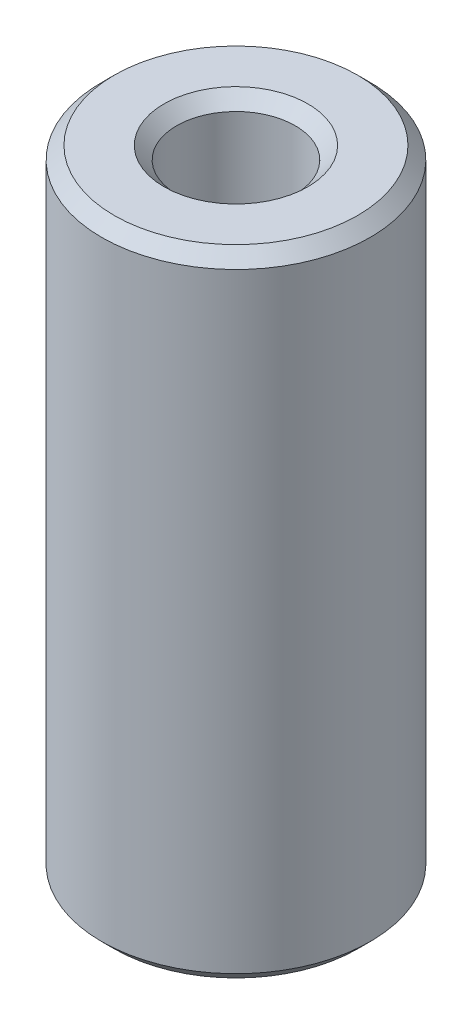
ISO-10303-21;
HEADER;
FILE_DESCRIPTION(('STEP AP214'),'2;1');
FILE_NAME('part.step','',(''),(''),'','','');
FILE_SCHEMA(('AUTOMOTIVE_DESIGN { 1 0 10303 214 1 1 1 1 }'));
ENDSEC;
DATA;
#1=APPLICATION_CONTEXT('core data for automotive mechanical design processes');
#2=APPLICATION_PROTOCOL_DEFINITION('international standard','automotive_design',2000,#1);
#3=PRODUCT_CONTEXT('',#1,'mechanical');
#4=PRODUCT('Part','Part','',(#3));
#5=PRODUCT_RELATED_PRODUCT_CATEGORY('part','',(#4));
#6=PRODUCT_DEFINITION_FORMATION('','',#4);
#7=PRODUCT_DEFINITION_CONTEXT('part definition',#1,'design');
#8=PRODUCT_DEFINITION('design','',#6,#7);
#9=PRODUCT_DEFINITION_SHAPE('','',#8);
#10=(LENGTH_UNIT() NAMED_UNIT(*) SI_UNIT(.MILLI.,.METRE.));
#11=(NAMED_UNIT(*) PLANE_ANGLE_UNIT() SI_UNIT($,.RADIAN.));
#12=(NAMED_UNIT(*) SI_UNIT($,.STERADIAN.) SOLID_ANGLE_UNIT());
#13=UNCERTAINTY_MEASURE_WITH_UNIT(LENGTH_MEASURE(1.E-05),#10,'distance_accuracy_value','');
#14=(GEOMETRIC_REPRESENTATION_CONTEXT(3) GLOBAL_UNCERTAINTY_ASSIGNED_CONTEXT((#13)) GLOBAL_UNIT_ASSIGNED_CONTEXT((#10,
#11,#12)) REPRESENTATION_CONTEXT('',''));
#15=CARTESIAN_POINT('',(0.,0.,0.));
#16=DIRECTION('',(0.,0.,1.));
#17=DIRECTION('',(1.,0.,0.));
#18=AXIS2_PLACEMENT_3D('',#15,#16,#17);
#19=CARTESIAN_POINT('',(0.,141.90652875905,0.));
#20=DIRECTION('',(0.,-1.,0.));
#21=DIRECTION('',(0.,0.,-1.));
#22=AXIS2_PLACEMENT_3D('',#19,#20,#21);
#23=CYLINDRICAL_SURFACE('',#22,30.);
#24=CARTESIAN_POINT('',(0.,2.82088200726871,0.));
#25=DIRECTION('',(0.,1.,0.));
#26=DIRECTION('',(0.,0.,1.));
#27=AXIS2_PLACEMENT_3D('',#24,#25,#26);
#28=CIRCLE('',#27,30.);
#29=CARTESIAN_POINT('',(0.,2.82088200726871,30.));
#30=VERTEX_POINT('',#29);
#31=EDGE_CURVE('E10',#30,#30,#28,.T.);
#32=ORIENTED_EDGE('',*,*,#31,.T.);
#33=EDGE_LOOP('',(#32));
#34=FACE_BOUND('',#33,.T.);
#35=CARTESIAN_POINT('',(0.,139.085646751781,0.));
#36=DIRECTION('',(0.,1.,0.));
#37=DIRECTION('',(0.,0.,1.));
#38=AXIS2_PLACEMENT_3D('',#35,#36,#37);
#39=CIRCLE('',#38,30.);
#40=CARTESIAN_POINT('',(0.,139.085646751781,30.));
#41=VERTEX_POINT('',#40);
#42=EDGE_CURVE('E50',#41,#41,#39,.F.);
#43=ORIENTED_EDGE('',*,*,#42,.T.);
#44=EDGE_LOOP('',(#43));
#45=FACE_BOUND('',#44,.T.);
#46=ADVANCED_FACE('F39',(#34,#45),#23,.T.);
#47=CARTESIAN_POINT('',(0.,141.90652875905,0.));
#48=DIRECTION('',(0.,1.,0.));
#49=DIRECTION('',(0.,0.,1.));
#50=AXIS2_PLACEMENT_3D('',#47,#48,#49);
#51=PLANE('',#50);
#52=CARTESIAN_POINT('',(0.,141.90652875905,0.));
#53=DIRECTION('',(0.,1.,0.));
#54=DIRECTION('',(0.,0.,1.));
#55=AXIS2_PLACEMENT_3D('',#52,#53,#54);
#56=CIRCLE('',#55,16.06842925978);
#57=CARTESIAN_POINT('',(0.,141.90652875905,16.06842925978));
#58=VERTEX_POINT('',#57);
#59=EDGE_CURVE('E58',#58,#58,#56,.F.);
#60=ORIENTED_EDGE('',*,*,#59,.T.);
#61=EDGE_LOOP('',(#60));
#62=FACE_BOUND('',#61,.T.);
#63=CARTESIAN_POINT('',(0.,141.90652875905,0.));
#64=DIRECTION('',(0.,1.,0.));
#65=DIRECTION('',(0.,0.,1.));
#66=AXIS2_PLACEMENT_3D('',#63,#64,#65);
#67=CIRCLE('',#66,27.1791179927313);
#68=CARTESIAN_POINT('',(0.,141.90652875905,27.1791179927313));
#69=VERTEX_POINT('',#68);
#70=EDGE_CURVE('E61',#69,#69,#67,.T.);
#71=ORIENTED_EDGE('',*,*,#70,.T.);
#72=EDGE_LOOP('',(#71));
#73=FACE_BOUND('',#72,.T.);
#74=ADVANCED_FACE('F88',(#62,#73),#51,.T.);
#75=CARTESIAN_POINT('',(0.,0.,0.));
#76=DIRECTION('',(0.,1.,0.));
#77=DIRECTION('',(0.,0.,1.));
#78=AXIS2_PLACEMENT_3D('',#75,#76,#77);
#79=PLANE('',#78);
#80=CARTESIAN_POINT('',(0.,0.,0.));
#81=DIRECTION('',(0.,1.,0.));
#82=DIRECTION('',(0.,0.,1.));
#83=AXIS2_PLACEMENT_3D('',#80,#81,#82);
#84=CIRCLE('',#83,16.06842925978);
#85=CARTESIAN_POINT('',(0.,0.,16.06842925978));
#86=VERTEX_POINT('',#85);
#87=EDGE_CURVE('E51',#86,#86,#84,.T.);
#88=ORIENTED_EDGE('',*,*,#87,.T.);
#89=EDGE_LOOP('',(#88));
#90=FACE_BOUND('',#89,.T.);
#91=CARTESIAN_POINT('',(0.,0.,0.));
#92=DIRECTION('',(0.,1.,0.));
#93=DIRECTION('',(0.,0.,1.));
#94=AXIS2_PLACEMENT_3D('',#91,#92,#93);
#95=CIRCLE('',#94,27.1791179927313);
#96=CARTESIAN_POINT('',(0.,0.,27.1791179927313));
#97=VERTEX_POINT('',#96);
#98=EDGE_CURVE('E54',#97,#97,#95,.F.);
#99=ORIENTED_EDGE('',*,*,#98,.T.);
#100=EDGE_LOOP('',(#99));
#101=FACE_BOUND('',#100,.T.);
#102=ADVANCED_FACE('F83',(#90,#101),#79,.F.);
#103=CARTESIAN_POINT('',(0.,141.90652875905,0.));
#104=DIRECTION('',(0.,-1.,0.));
#105=DIRECTION('',(0.,0.,-1.));
#106=AXIS2_PLACEMENT_3D('',#103,#104,#105);
#107=CYLINDRICAL_SURFACE('',#106,13.2475472525113);
#108=CARTESIAN_POINT('',(0.,139.085646751781,0.));
#109=DIRECTION('',(0.,1.,0.));
#110=DIRECTION('',(0.,0.,1.));
#111=AXIS2_PLACEMENT_3D('',#108,#109,#110);
#112=CIRCLE('',#111,13.2475472525113);
#113=CARTESIAN_POINT('',(0.,139.085646751781,13.2475472525113));
#114=VERTEX_POINT('',#113);
#115=EDGE_CURVE('E67',#114,#114,#112,.T.);
#116=ORIENTED_EDGE('',*,*,#115,.T.);
#117=EDGE_LOOP('',(#116));
#118=FACE_BOUND('',#117,.T.);
#119=CARTESIAN_POINT('',(0.,2.82088200726874,0.));
#120=DIRECTION('',(0.,1.,0.));
#121=DIRECTION('',(0.,0.,1.));
#122=AXIS2_PLACEMENT_3D('',#119,#120,#121);
#123=CIRCLE('',#122,13.2475472525113);
#124=CARTESIAN_POINT('',(0.,2.82088200726874,13.2475472525113));
#125=VERTEX_POINT('',#124);
#126=EDGE_CURVE('E69',#125,#125,#123,.F.);
#127=ORIENTED_EDGE('',*,*,#126,.T.);
#128=EDGE_LOOP('',(#127));
#129=FACE_BOUND('',#128,.T.);
#130=ADVANCED_FACE('F71',(#118,#129),#107,.F.);
#131=CARTESIAN_POINT('',(0.,139.085646751781,0.));
#132=DIRECTION('',(0.,1.,0.));
#133=DIRECTION('',(0.,0.,1.));
#134=AXIS2_PLACEMENT_3D('',#131,#132,#133);
#135=CONICAL_SURFACE('',#134,13.2475472525113,0.78539816339745);
#136=CARTESIAN_POINT('',(0.,141.90652875905,16.06842925978));
#137=CARTESIAN_POINT('',(0.,141.877144571474,16.0390450722043));
#138=CARTESIAN_POINT('',(0.,141.847760383899,16.0096608846286));
#139=CARTESIAN_POINT('',(0.,141.788992008747,15.9508925094771));
#140=CARTESIAN_POINT('',(0.,141.759607821171,15.9215083219014));
#141=CARTESIAN_POINT('',(0.,141.70083944602,15.86273994675));
#142=CARTESIAN_POINT('',(0.,141.671455258444,15.8333557591743));
#143=CARTESIAN_POINT('',(0.,141.612686883293,15.7745873840228));
#144=CARTESIAN_POINT('',(0.,141.583302695717,15.7452031964471));
#145=CARTESIAN_POINT('',(0.,141.524534320566,15.6864348212957));
#146=CARTESIAN_POINT('',(0.,141.49515013299,15.65705063372));
#147=CARTESIAN_POINT('',(0.,141.436381757839,15.5982822585685));
#148=CARTESIAN_POINT('',(0.,141.406997570263,15.5688980709928));
#149=CARTESIAN_POINT('',(0.,141.348229195111,15.5101296958414));
#150=CARTESIAN_POINT('',(0.,141.318845007536,15.4807455082657));
#151=CARTESIAN_POINT('',(0.,141.260076632384,15.4219771331142));
#152=CARTESIAN_POINT('',(0.,141.230692444809,15.3925929455385));
#153=CARTESIAN_POINT('',(0.,141.171924069657,15.3338245703871));
#154=CARTESIAN_POINT('',(0.,141.142539882081,15.3044403828114));
#155=CARTESIAN_POINT('',(0.,141.08377150693,15.2456720076599));
#156=CARTESIAN_POINT('',(0.,141.054387319354,15.2162878200842));
#157=CARTESIAN_POINT('',(0.,140.995618944203,15.1575194449328));
#158=CARTESIAN_POINT('',(0.,140.966234756627,15.1281352573571));
#159=CARTESIAN_POINT('',(0.,140.907466381476,15.0693668822057));
#160=CARTESIAN_POINT('',(0.,140.8780821939,15.0399826946299));
#161=CARTESIAN_POINT('',(0.,140.819313818749,14.9812143194785));
#162=CARTESIAN_POINT('',(0.,140.789929631173,14.9518301319028));
#163=CARTESIAN_POINT('',(0.,140.731161256021,14.8930617567514));
#164=CARTESIAN_POINT('',(0.,140.701777068446,14.8636775691756));
#165=CARTESIAN_POINT('',(0.,140.643008693294,14.8049091940242));
#166=CARTESIAN_POINT('',(0.,140.613624505719,14.7755250064485));
#167=CARTESIAN_POINT('',(0.,140.554856130567,14.7167566312971));
#168=CARTESIAN_POINT('',(0.,140.525471942991,14.6873724437214));
#169=CARTESIAN_POINT('',(0.,140.46670356784,14.6286040685699));
#170=CARTESIAN_POINT('',(0.,140.437319380264,14.5992198809942));
#171=CARTESIAN_POINT('',(0.,140.378551005113,14.5404515058428));
#172=CARTESIAN_POINT('',(0.,140.349166817537,14.5110673182671));
#173=CARTESIAN_POINT('',(0.,140.290398442386,14.4522989431156));
#174=CARTESIAN_POINT('',(0.,140.26101425481,14.4229147555399));
#175=CARTESIAN_POINT('',(0.,140.202245879659,14.3641463803885));
#176=CARTESIAN_POINT('',(0.,140.172861692083,14.3347621928128));
#177=CARTESIAN_POINT('',(0.,140.114093316931,14.2759938176613));
#178=CARTESIAN_POINT('',(0.,140.084709129356,14.2466096300856));
#179=CARTESIAN_POINT('',(0.,140.025940754204,14.1878412549342));
#180=CARTESIAN_POINT('',(0.,139.996556566629,14.1584570673585));
#181=CARTESIAN_POINT('',(0.,139.937788191477,14.099688692207));
#182=CARTESIAN_POINT('',(0.,139.908404003901,14.0703045046313));
#183=CARTESIAN_POINT('',(0.,139.84963562875,14.0115361294799));
#184=CARTESIAN_POINT('',(0.,139.820251441174,13.9821519419042));
#185=CARTESIAN_POINT('',(0.,139.761483066023,13.9233835667527));
#186=CARTESIAN_POINT('',(0.,139.732098878447,13.893999379177));
#187=CARTESIAN_POINT('',(0.,139.673330503296,13.8352310040256));
#188=CARTESIAN_POINT('',(0.,139.64394631572,13.8058468164499));
#189=CARTESIAN_POINT('',(0.,139.585177940569,13.7470784412985));
#190=CARTESIAN_POINT('',(0.,139.555793752993,13.7176942537227));
#191=CARTESIAN_POINT('',(0.,139.497025377841,13.6589258785713));
#192=CARTESIAN_POINT('',(0.,139.467641190266,13.6295416909956));
#193=CARTESIAN_POINT('',(0.,139.408872815114,13.5707733158442));
#194=CARTESIAN_POINT('',(0.,139.379488627539,13.5413891282684));
#195=CARTESIAN_POINT('',(0.,139.320720252387,13.482620753117));
#196=CARTESIAN_POINT('',(0.,139.291336064811,13.4532365655413));
#197=CARTESIAN_POINT('',(0.,139.23256768966,13.3944681903899));
#198=CARTESIAN_POINT('',(0.,139.203183502084,13.3650840028142));
#199=CARTESIAN_POINT('',(0.,139.144415126933,13.3063156276627));
#200=CARTESIAN_POINT('',(0.,139.115030939357,13.276931440087));
#201=CARTESIAN_POINT('',(0.,139.085646751781,13.2475472525113));
#202=B_SPLINE_CURVE_WITH_KNOTS('',3,(#136,#137,#138,#139,#140,#141,#142,#143,#144,#145,#146,
#147,#148,#149,#150,#151,#152,#153,#154,#155,#156,#157,#158,#159,#160,#161,#162,#163,#164,#165,
#166,#167,#168,#169,#170,#171,#172,#173,#174,#175,#176,#177,#178,#179,#180,#181,#182,#183,#184,
#185,#186,#187,#188,#189,#190,#191,#192,#193,#194,#195,#196,#197,#198,#199,#200,#201),
.UNSPECIFIED.,.F.,.F.,(4,2,2,2,2,2,2,2,2,2,2,2,2,2,2,2,2,2,2,2,2,2,2,2,2,2,2,2,2,2,2,2,4),(0.,
0.124666549766679,0.249333099533358,0.373999649300034,0.498666199066713,0.623332748833392,
0.747999298600071,0.87266584836673,0.997332398133408,1.12199894790009,1.24666549766677,
1.37133204743344,1.49599859720012,1.62066514696678,1.74533169673346,1.86999824650014,
1.99466479626682,2.1193313460335,2.24399789580018,2.36866444556685,2.49333099533351,
2.61799754510019,2.74266409486687,2.86733064463355,2.99199719440023,3.11666374416691,
3.24133029393357,3.36599684370024,3.49066339346692,3.6153299432336,3.73999649300028,
3.86466304276696,3.98932959253362),.UNSPECIFIED.);
#203=EDGE_CURVE('BSEAM77',#58,#114,#202,.T.);
#204=ORIENTED_EDGE('',*,*,#59,.F.);
#205=ORIENTED_EDGE('',*,*,#115,.F.);
#206=ORIENTED_EDGE('',*,*,#203,.T.);
#207=ORIENTED_EDGE('',*,*,#203,.F.);
#208=EDGE_LOOP('',(#204,#206,#205,#207));
#209=FACE_BOUND('',#208,.T.);
#210=ADVANCED_FACE('F77',(#209),#135,.F.);
#211=CARTESIAN_POINT('',(0.,0.,0.));
#212=DIRECTION('',(0.,-1.,0.));
#213=DIRECTION('',(0.,0.,-1.));
#214=AXIS2_PLACEMENT_3D('',#211,#212,#213);
#215=CONICAL_SURFACE('',#214,16.06842925978,0.785398163397443);
#216=ORIENTED_EDGE('',*,*,#126,.F.);
#217=EDGE_LOOP('',(#216));
#218=FACE_BOUND('',#217,.T.);
#219=ORIENTED_EDGE('',*,*,#87,.F.);
#220=EDGE_LOOP('',(#219));
#221=FACE_BOUND('',#220,.T.);
#222=ADVANCED_FACE('F73',(#218,#221),#215,.F.);
#223=CARTESIAN_POINT('',(0.,2.82088200726871,0.));
#224=DIRECTION('',(0.,1.,0.));
#225=DIRECTION('',(0.,0.,1.));
#226=AXIS2_PLACEMENT_3D('',#223,#224,#225);
#227=CONICAL_SURFACE('',#226,30.,0.785398163397453);
#228=ORIENTED_EDGE('',*,*,#98,.F.);
#229=EDGE_LOOP('',(#228));
#230=FACE_BOUND('',#229,.T.);
#231=ORIENTED_EDGE('',*,*,#31,.F.);
#232=EDGE_LOOP('',(#231));
#233=FACE_BOUND('',#232,.T.);
#234=ADVANCED_FACE('F76',(#230,#233),#227,.T.);
#235=CARTESIAN_POINT('',(0.,141.90652875905,0.));
#236=DIRECTION('',(0.,-1.,0.));
#237=DIRECTION('',(0.,0.,-1.));
#238=AXIS2_PLACEMENT_3D('',#235,#236,#237);
#239=CONICAL_SURFACE('',#238,27.1791179927313,0.785398163397446);
#240=ORIENTED_EDGE('',*,*,#42,.F.);
#241=EDGE_LOOP('',(#240));
#242=FACE_BOUND('',#241,.T.);
#243=ORIENTED_EDGE('',*,*,#70,.F.);
#244=EDGE_LOOP('',(#243));
#245=FACE_BOUND('',#244,.T.);
#246=ADVANCED_FACE('F45',(#242,#245),#239,.T.);
#247=CLOSED_SHELL('',(#46,#74,#102,#130,#210,#222,#234,#246));
#248=MANIFOLD_SOLID_BREP('B2',#247);
#249=ADVANCED_BREP_SHAPE_REPRESENTATION('',(#18,#248),#14);
#250=SHAPE_DEFINITION_REPRESENTATION(#9,#249);
ENDSEC;
END-ISO-10303-21;
